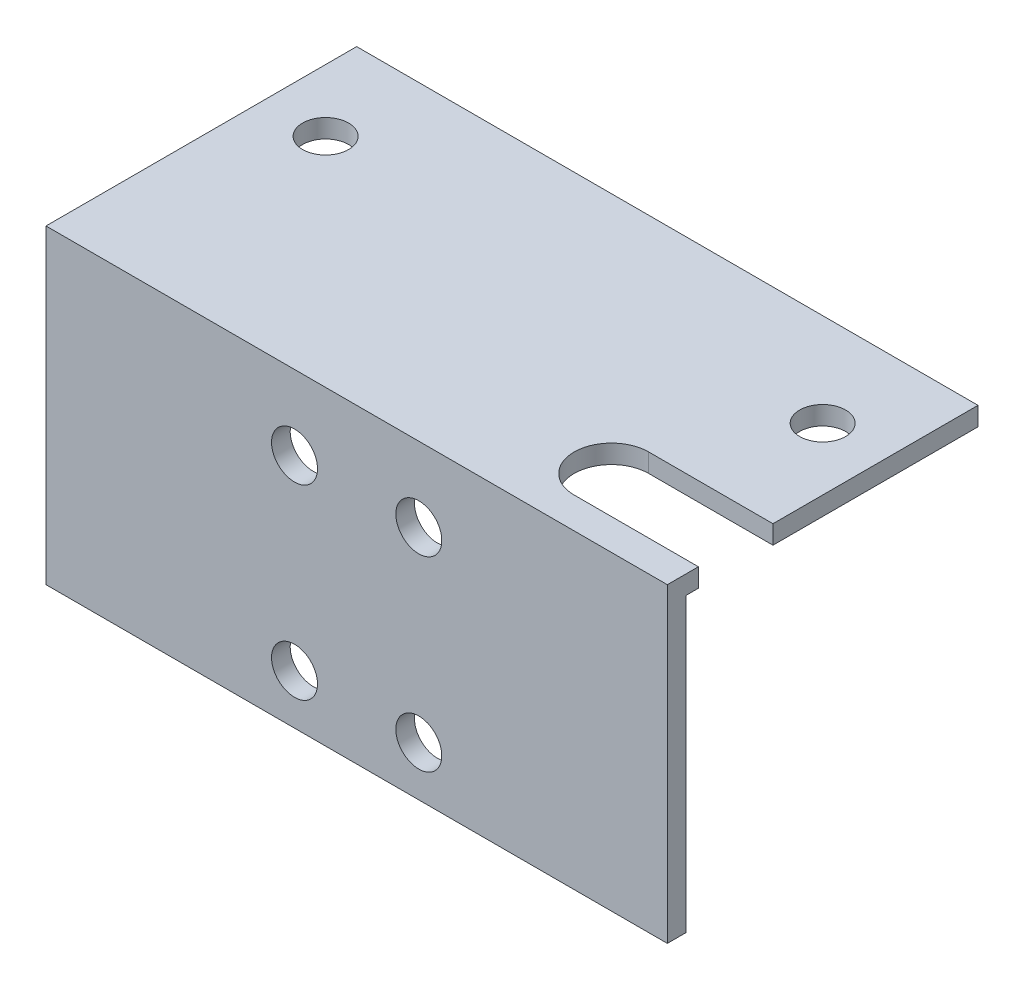
ISO-10303-21;
HEADER;
FILE_DESCRIPTION(('STEP AP214'),'2;1');
FILE_NAME('part.step','',(''),(''),'','','');
FILE_SCHEMA(('AUTOMOTIVE_DESIGN { 1 0 10303 214 1 1 1 1 }'));
ENDSEC;
DATA;
#1=APPLICATION_CONTEXT('core data for automotive mechanical design processes');
#2=APPLICATION_PROTOCOL_DEFINITION('international standard','automotive_design',2000,#1);
#3=PRODUCT_CONTEXT('',#1,'mechanical');
#4=PRODUCT('Part','Part','',(#3));
#5=PRODUCT_RELATED_PRODUCT_CATEGORY('part','',(#4));
#6=PRODUCT_DEFINITION_FORMATION('','',#4);
#7=PRODUCT_DEFINITION_CONTEXT('part definition',#1,'design');
#8=PRODUCT_DEFINITION('design','',#6,#7);
#9=PRODUCT_DEFINITION_SHAPE('','',#8);
#10=(LENGTH_UNIT() NAMED_UNIT(*) SI_UNIT(.MILLI.,.METRE.));
#11=(NAMED_UNIT(*) PLANE_ANGLE_UNIT() SI_UNIT($,.RADIAN.));
#12=(NAMED_UNIT(*) SI_UNIT($,.STERADIAN.) SOLID_ANGLE_UNIT());
#13=UNCERTAINTY_MEASURE_WITH_UNIT(LENGTH_MEASURE(1.E-05),#10,'distance_accuracy_value','');
#14=(GEOMETRIC_REPRESENTATION_CONTEXT(3) GLOBAL_UNCERTAINTY_ASSIGNED_CONTEXT((#13)) GLOBAL_UNIT_ASSIGNED_CONTEXT((#10,
#11,#12)) REPRESENTATION_CONTEXT('',''));
#15=CARTESIAN_POINT('',(0.,0.,0.));
#16=DIRECTION('',(0.,0.,1.));
#17=DIRECTION('',(1.,0.,0.));
#18=AXIS2_PLACEMENT_3D('',#15,#16,#17);
#19=CARTESIAN_POINT('',(50.,1.5,0.));
#20=DIRECTION('',(-1.,0.,0.));
#21=DIRECTION('',(0.,0.,1.));
#22=AXIS2_PLACEMENT_3D('',#19,#20,#21);
#23=PLANE('',#22);
#24=DIRECTION('',(0.,0.,-1.));
#25=VECTOR('',#24,1.);
#26=CARTESIAN_POINT('',(50.,1.5,0.));
#27=LINE('',#26,#25);
#28=CARTESIAN_POINT('',(50.,1.5,-8.5));
#29=VERTEX_POINT('',#28);
#30=CARTESIAN_POINT('',(50.,1.5,-25.));
#31=VERTEX_POINT('',#30);
#32=EDGE_CURVE('E197',#29,#31,#27,.T.);
#33=ORIENTED_EDGE('',*,*,#32,.F.);
#34=DIRECTION('',(0.,-1.,0.));
#35=VECTOR('',#34,1.);
#36=CARTESIAN_POINT('',(50.,1.5,-8.5));
#37=LINE('',#36,#35);
#38=CARTESIAN_POINT('',(50.,0.,-8.5));
#39=VERTEX_POINT('',#38);
#40=EDGE_CURVE('E11',#29,#39,#37,.T.);
#41=ORIENTED_EDGE('',*,*,#40,.T.);
#42=DIRECTION('',(0.,0.,-1.));
#43=VECTOR('',#42,1.);
#44=CARTESIAN_POINT('',(50.,0.,0.));
#45=LINE('',#44,#43);
#46=CARTESIAN_POINT('',(50.,0.,-25.));
#47=VERTEX_POINT('',#46);
#48=EDGE_CURVE('E133',#39,#47,#45,.T.);
#49=ORIENTED_EDGE('',*,*,#48,.T.);
#50=DIRECTION('',(0.,-1.,0.));
#51=VECTOR('',#50,1.);
#52=CARTESIAN_POINT('',(50.,1.5,-25.));
#53=LINE('',#52,#51);
#54=EDGE_CURVE('E144',#31,#47,#53,.T.);
#55=ORIENTED_EDGE('',*,*,#54,.F.);
#56=EDGE_LOOP('',(#33,#41,#49,#55));
#57=FACE_BOUND('',#56,.T.);
#58=ADVANCED_FACE('F34',(#57),#23,.F.);
#59=CARTESIAN_POINT('',(0.,1.5,0.));
#60=DIRECTION('',(0.,-1.,0.));
#61=DIRECTION('',(0.,0.,-1.));
#62=AXIS2_PLACEMENT_3D('',#59,#60,#61);
#63=PLANE('',#62);
#64=CARTESIAN_POINT('',(40.,1.5,-5.5));
#65=DIRECTION('',(0.,-1.,0.));
#66=DIRECTION('',(0.,0.,-1.));
#67=AXIS2_PLACEMENT_3D('',#64,#65,#66);
#68=CIRCLE('',#67,3.);
#69=CARTESIAN_POINT('',(40.,1.5,-2.5));
#70=VERTEX_POINT('',#69);
#71=CARTESIAN_POINT('',(40.,1.5,-8.5));
#72=VERTEX_POINT('',#71);
#73=EDGE_CURVE('E218',#70,#72,#68,.T.);
#74=ORIENTED_EDGE('',*,*,#73,.T.);
#75=DIRECTION('',(1.,0.,0.));
#76=VECTOR('',#75,1.);
#77=CARTESIAN_POINT('',(0.,1.5,-8.50000000000002));
#78=LINE('',#77,#76);
#79=EDGE_CURVE('E216',#72,#29,#78,.T.);
#80=ORIENTED_EDGE('',*,*,#79,.T.);
#81=ORIENTED_EDGE('',*,*,#32,.T.);
#82=DIRECTION('',(-1.,0.,0.));
#83=VECTOR('',#82,1.);
#84=CARTESIAN_POINT('',(0.,1.5,-25.));
#85=LINE('',#84,#83);
#86=CARTESIAN_POINT('',(0.,1.5,-25.));
#87=VERTEX_POINT('',#86);
#88=EDGE_CURVE('E145',#31,#87,#85,.T.);
#89=ORIENTED_EDGE('',*,*,#88,.T.);
#90=DIRECTION('',(0.,0.,1.));
#91=VECTOR('',#90,1.);
#92=CARTESIAN_POINT('',(0.,1.5,0.));
#93=LINE('',#92,#91);
#94=CARTESIAN_POINT('',(0.,1.5,0.));
#95=VERTEX_POINT('',#94);
#96=EDGE_CURVE('E135',#87,#95,#93,.T.);
#97=ORIENTED_EDGE('',*,*,#96,.T.);
#98=DIRECTION('',(1.,0.,0.));
#99=VECTOR('',#98,1.);
#100=CARTESIAN_POINT('',(0.,1.5,0.));
#101=LINE('',#100,#99);
#102=CARTESIAN_POINT('',(50.,1.5,0.));
#103=VERTEX_POINT('',#102);
#104=EDGE_CURVE('E157',#95,#103,#101,.T.);
#105=ORIENTED_EDGE('',*,*,#104,.T.);
#106=CARTESIAN_POINT('',(50.,1.5,-2.5));
#107=VERTEX_POINT('',#106);
#108=EDGE_CURVE('E198',#103,#107,#27,.T.);
#109=ORIENTED_EDGE('',*,*,#108,.T.);
#110=DIRECTION('',(-1.,0.,0.));
#111=VECTOR('',#110,1.);
#112=CARTESIAN_POINT('',(0.,1.5,-2.5));
#113=LINE('',#112,#111);
#114=EDGE_CURVE('E49',#107,#70,#113,.T.);
#115=ORIENTED_EDGE('',*,*,#114,.T.);
#116=EDGE_LOOP('',(#74,#80,#81,#89,#97,#105,#109,#115));
#117=FACE_BOUND('',#116,.T.);
#118=CARTESIAN_POINT('',(5.,1.5,-17.5));
#119=DIRECTION('',(0.,1.,0.));
#120=DIRECTION('',(0.,0.,1.));
#121=AXIS2_PLACEMENT_3D('',#118,#119,#120);
#122=CIRCLE('',#121,1.85);
#123=CARTESIAN_POINT('',(5.,1.5,-15.65));
#124=VERTEX_POINT('',#123);
#125=EDGE_CURVE('E190',#124,#124,#122,.T.);
#126=ORIENTED_EDGE('',*,*,#125,.F.);
#127=EDGE_LOOP('',(#126));
#128=FACE_BOUND('',#127,.T.);
#129=CARTESIAN_POINT('',(45.,1.5,-17.5));
#130=DIRECTION('',(0.,1.,0.));
#131=DIRECTION('',(0.,0.,1.));
#132=AXIS2_PLACEMENT_3D('',#129,#130,#131);
#133=CIRCLE('',#132,1.85);
#134=CARTESIAN_POINT('',(45.,1.5,-15.65));
#135=VERTEX_POINT('',#134);
#136=EDGE_CURVE('E184',#135,#135,#133,.T.);
#137=ORIENTED_EDGE('',*,*,#136,.F.);
#138=EDGE_LOOP('',(#137));
#139=FACE_BOUND('',#138,.T.);
#140=ADVANCED_FACE('F203',(#117,#128,#139),#63,.F.);
#141=CARTESIAN_POINT('',(0.,0.,0.));
#142=DIRECTION('',(0.,-1.,0.));
#143=DIRECTION('',(0.,0.,-1.));
#144=AXIS2_PLACEMENT_3D('',#141,#142,#143);
#145=PLANE('',#144);
#146=DIRECTION('',(1.,0.,0.));
#147=VECTOR('',#146,1.);
#148=CARTESIAN_POINT('',(50.,0.,-8.5));
#149=LINE('',#148,#147);
#150=CARTESIAN_POINT('',(40.,0.,-8.5));
#151=VERTEX_POINT('',#150);
#152=EDGE_CURVE('E212',#151,#39,#149,.T.);
#153=ORIENTED_EDGE('',*,*,#152,.F.);
#154=CARTESIAN_POINT('',(40.,0.,-5.5));
#155=DIRECTION('',(0.,-1.,0.));
#156=DIRECTION('',(0.,0.,-1.));
#157=AXIS2_PLACEMENT_3D('',#154,#155,#156);
#158=CIRCLE('',#157,3.);
#159=CARTESIAN_POINT('',(40.,0.,-2.5));
#160=VERTEX_POINT('',#159);
#161=EDGE_CURVE('E125',#160,#151,#158,.T.);
#162=ORIENTED_EDGE('',*,*,#161,.F.);
#163=DIRECTION('',(-1.,0.,0.));
#164=VECTOR('',#163,1.);
#165=CARTESIAN_POINT('',(50.,0.,-2.5));
#166=LINE('',#165,#164);
#167=CARTESIAN_POINT('',(50.,0.,-2.5));
#168=VERTEX_POINT('',#167);
#169=EDGE_CURVE('E113',#168,#160,#166,.T.);
#170=ORIENTED_EDGE('',*,*,#169,.F.);
#171=CARTESIAN_POINT('',(50.,0.,-1.5));
#172=VERTEX_POINT('',#171);
#173=EDGE_CURVE('E123',#172,#168,#45,.T.);
#174=ORIENTED_EDGE('',*,*,#173,.F.);
#175=DIRECTION('',(1.,0.,0.));
#176=VECTOR('',#175,1.);
#177=CARTESIAN_POINT('',(0.,0.,-1.5));
#178=LINE('',#177,#176);
#179=CARTESIAN_POINT('',(0.,0.,-1.5));
#180=VERTEX_POINT('',#179);
#181=EDGE_CURVE('E57',#180,#172,#178,.T.);
#182=ORIENTED_EDGE('',*,*,#181,.F.);
#183=DIRECTION('',(0.,0.,1.));
#184=VECTOR('',#183,1.);
#185=CARTESIAN_POINT('',(0.,0.,0.));
#186=LINE('',#185,#184);
#187=CARTESIAN_POINT('',(0.,0.,-25.));
#188=VERTEX_POINT('',#187);
#189=EDGE_CURVE('E137',#188,#180,#186,.T.);
#190=ORIENTED_EDGE('',*,*,#189,.F.);
#191=DIRECTION('',(-1.,0.,0.));
#192=VECTOR('',#191,1.);
#193=CARTESIAN_POINT('',(0.,0.,-25.));
#194=LINE('',#193,#192);
#195=EDGE_CURVE('E132',#47,#188,#194,.T.);
#196=ORIENTED_EDGE('',*,*,#195,.F.);
#197=ORIENTED_EDGE('',*,*,#48,.F.);
#198=EDGE_LOOP('',(#153,#162,#170,#174,#182,#190,#196,#197));
#199=FACE_BOUND('',#198,.T.);
#200=CARTESIAN_POINT('',(5.,0.,-17.5));
#201=DIRECTION('',(0.,1.,0.));
#202=DIRECTION('',(0.,0.,1.));
#203=AXIS2_PLACEMENT_3D('',#200,#201,#202);
#204=CIRCLE('',#203,1.85);
#205=CARTESIAN_POINT('',(5.,0.,-15.65));
#206=VERTEX_POINT('',#205);
#207=EDGE_CURVE('E187',#206,#206,#204,.T.);
#208=ORIENTED_EDGE('',*,*,#207,.T.);
#209=EDGE_LOOP('',(#208));
#210=FACE_BOUND('',#209,.T.);
#211=CARTESIAN_POINT('',(45.,0.,-17.5));
#212=DIRECTION('',(0.,1.,0.));
#213=DIRECTION('',(0.,0.,1.));
#214=AXIS2_PLACEMENT_3D('',#211,#212,#213);
#215=CIRCLE('',#214,1.85);
#216=CARTESIAN_POINT('',(45.,0.,-15.65));
#217=VERTEX_POINT('',#216);
#218=EDGE_CURVE('E183',#217,#217,#215,.T.);
#219=ORIENTED_EDGE('',*,*,#218,.T.);
#220=EDGE_LOOP('',(#219));
#221=FACE_BOUND('',#220,.T.);
#222=ADVANCED_FACE('F121',(#199,#210,#221),#145,.T.);
#223=CARTESIAN_POINT('',(0.,1.5,0.));
#224=DIRECTION('',(1.,0.,0.));
#225=DIRECTION('',(0.,0.,-1.));
#226=AXIS2_PLACEMENT_3D('',#223,#224,#225);
#227=PLANE('',#226);
#228=ORIENTED_EDGE('',*,*,#189,.T.);
#229=DIRECTION('',(0.,1.,0.));
#230=VECTOR('',#229,1.);
#231=CARTESIAN_POINT('',(0.,-23.5,-1.5));
#232=LINE('',#231,#230);
#233=CARTESIAN_POINT('',(0.,-23.5,-1.5));
#234=VERTEX_POINT('',#233);
#235=EDGE_CURVE('E171',#234,#180,#232,.T.);
#236=ORIENTED_EDGE('',*,*,#235,.F.);
#237=DIRECTION('',(0.,0.,-1.));
#238=VECTOR('',#237,1.);
#239=CARTESIAN_POINT('',(0.,-23.5,0.));
#240=LINE('',#239,#238);
#241=CARTESIAN_POINT('',(0.,-23.5,0.));
#242=VERTEX_POINT('',#241);
#243=EDGE_CURVE('E166',#242,#234,#240,.T.);
#244=ORIENTED_EDGE('',*,*,#243,.F.);
#245=DIRECTION('',(0.,-1.,0.));
#246=VECTOR('',#245,1.);
#247=CARTESIAN_POINT('',(0.,1.5,0.));
#248=LINE('',#247,#246);
#249=EDGE_CURVE('E119',#95,#242,#248,.T.);
#250=ORIENTED_EDGE('',*,*,#249,.F.);
#251=ORIENTED_EDGE('',*,*,#96,.F.);
#252=DIRECTION('',(0.,-1.,0.));
#253=VECTOR('',#252,1.);
#254=CARTESIAN_POINT('',(0.,1.5,-25.));
#255=LINE('',#254,#253);
#256=EDGE_CURVE('E141',#87,#188,#255,.T.);
#257=ORIENTED_EDGE('',*,*,#256,.T.);
#258=EDGE_LOOP('',(#228,#236,#244,#250,#251,#257));
#259=FACE_BOUND('',#258,.T.);
#260=ADVANCED_FACE('F36',(#259),#227,.F.);
#261=CARTESIAN_POINT('',(0.,1.5,0.));
#262=DIRECTION('',(0.,0.,-1.));
#263=DIRECTION('',(-1.,0.,0.));
#264=AXIS2_PLACEMENT_3D('',#261,#262,#263);
#265=PLANE('',#264);
#266=CARTESIAN_POINT('',(30.,-19.5,0.));
#267=DIRECTION('',(0.,0.,-1.));
#268=DIRECTION('',(-1.,0.,0.));
#269=AXIS2_PLACEMENT_3D('',#266,#267,#268);
#270=CIRCLE('',#269,1.85);
#271=CARTESIAN_POINT('',(28.15,-19.5,0.));
#272=VERTEX_POINT('',#271);
#273=EDGE_CURVE('E175',#272,#272,#270,.T.);
#274=ORIENTED_EDGE('',*,*,#273,.T.);
#275=EDGE_LOOP('',(#274));
#276=FACE_BOUND('',#275,.T.);
#277=CARTESIAN_POINT('',(20.,-4.49999999999999,0.));
#278=DIRECTION('',(0.,0.,-1.));
#279=DIRECTION('',(-1.,0.,0.));
#280=AXIS2_PLACEMENT_3D('',#277,#278,#279);
#281=CIRCLE('',#280,1.85);
#282=CARTESIAN_POINT('',(18.15,-4.49999999999999,0.));
#283=VERTEX_POINT('',#282);
#284=EDGE_CURVE('E242',#283,#283,#281,.T.);
#285=ORIENTED_EDGE('',*,*,#284,.T.);
#286=EDGE_LOOP('',(#285));
#287=FACE_BOUND('',#286,.T.);
#288=CARTESIAN_POINT('',(30.,-4.49999999999999,0.));
#289=DIRECTION('',(0.,0.,-1.));
#290=DIRECTION('',(-1.,0.,0.));
#291=AXIS2_PLACEMENT_3D('',#288,#289,#290);
#292=CIRCLE('',#291,1.85);
#293=CARTESIAN_POINT('',(28.15,-4.49999999999999,0.));
#294=VERTEX_POINT('',#293);
#295=EDGE_CURVE('E240',#294,#294,#292,.T.);
#296=ORIENTED_EDGE('',*,*,#295,.T.);
#297=EDGE_LOOP('',(#296));
#298=FACE_BOUND('',#297,.T.);
#299=CARTESIAN_POINT('',(20.,-19.5,0.));
#300=DIRECTION('',(0.,0.,-1.));
#301=DIRECTION('',(-1.,0.,0.));
#302=AXIS2_PLACEMENT_3D('',#299,#300,#301);
#303=CIRCLE('',#302,1.85);
#304=CARTESIAN_POINT('',(18.15,-19.5,0.));
#305=VERTEX_POINT('',#304);
#306=EDGE_CURVE('E237',#305,#305,#303,.T.);
#307=ORIENTED_EDGE('',*,*,#306,.T.);
#308=EDGE_LOOP('',(#307));
#309=FACE_BOUND('',#308,.T.);
#310=ORIENTED_EDGE('',*,*,#249,.T.);
#311=DIRECTION('',(-1.,0.,0.));
#312=VECTOR('',#311,1.);
#313=CARTESIAN_POINT('',(0.,-23.5,0.));
#314=LINE('',#313,#312);
#315=CARTESIAN_POINT('',(50.,-23.5,0.));
#316=VERTEX_POINT('',#315);
#317=EDGE_CURVE('E156',#316,#242,#314,.T.);
#318=ORIENTED_EDGE('',*,*,#317,.F.);
#319=DIRECTION('',(0.,-1.,0.));
#320=VECTOR('',#319,1.);
#321=CARTESIAN_POINT('',(50.,1.5,0.));
#322=LINE('',#321,#320);
#323=EDGE_CURVE('E148',#103,#316,#322,.T.);
#324=ORIENTED_EDGE('',*,*,#323,.F.);
#325=ORIENTED_EDGE('',*,*,#104,.F.);
#326=EDGE_LOOP('',(#310,#318,#324,#325));
#327=FACE_BOUND('',#326,.T.);
#328=ADVANCED_FACE('F154',(#276,#287,#298,#309,#327),#265,.F.);
#329=ORIENTED_EDGE('',*,*,#173,.T.);
#330=DIRECTION('',(0.,1.,0.));
#331=VECTOR('',#330,1.);
#332=CARTESIAN_POINT('',(50.,1.5,-2.5));
#333=LINE('',#332,#331);
#334=EDGE_CURVE('E42',#168,#107,#333,.T.);
#335=ORIENTED_EDGE('',*,*,#334,.T.);
#336=ORIENTED_EDGE('',*,*,#108,.F.);
#337=ORIENTED_EDGE('',*,*,#323,.T.);
#338=DIRECTION('',(0.,0.,1.));
#339=VECTOR('',#338,1.);
#340=CARTESIAN_POINT('',(50.,-23.5,0.));
#341=LINE('',#340,#339);
#342=CARTESIAN_POINT('',(50.,-23.5,-1.5));
#343=VERTEX_POINT('',#342);
#344=EDGE_CURVE('E168',#343,#316,#341,.T.);
#345=ORIENTED_EDGE('',*,*,#344,.F.);
#346=DIRECTION('',(0.,1.,0.));
#347=VECTOR('',#346,1.);
#348=CARTESIAN_POINT('',(50.,-23.5,-1.5));
#349=LINE('',#348,#347);
#350=EDGE_CURVE('E131',#343,#172,#349,.T.);
#351=ORIENTED_EDGE('',*,*,#350,.T.);
#352=EDGE_LOOP('',(#329,#335,#336,#337,#345,#351));
#353=FACE_BOUND('',#352,.T.);
#354=ADVANCED_FACE('F128',(#353),#23,.F.);
#355=CARTESIAN_POINT('',(0.,1.5,-25.));
#356=DIRECTION('',(0.,0.,1.));
#357=DIRECTION('',(1.,0.,0.));
#358=AXIS2_PLACEMENT_3D('',#355,#356,#357);
#359=PLANE('',#358);
#360=ORIENTED_EDGE('',*,*,#195,.T.);
#361=ORIENTED_EDGE('',*,*,#256,.F.);
#362=ORIENTED_EDGE('',*,*,#88,.F.);
#363=ORIENTED_EDGE('',*,*,#54,.T.);
#364=EDGE_LOOP('',(#360,#361,#362,#363));
#365=FACE_BOUND('',#364,.T.);
#366=ADVANCED_FACE('F209',(#365),#359,.F.);
#367=CARTESIAN_POINT('',(5.,1.5,-17.5));
#368=DIRECTION('',(0.,-1.,0.));
#369=DIRECTION('',(0.,0.,-1.));
#370=AXIS2_PLACEMENT_3D('',#367,#368,#369);
#371=CYLINDRICAL_SURFACE('',#370,1.85);
#372=ORIENTED_EDGE('',*,*,#125,.T.);
#373=EDGE_LOOP('',(#372));
#374=FACE_BOUND('',#373,.T.);
#375=ORIENTED_EDGE('',*,*,#207,.F.);
#376=EDGE_LOOP('',(#375));
#377=FACE_BOUND('',#376,.T.);
#378=ADVANCED_FACE('F278',(#374,#377),#371,.F.);
#379=CARTESIAN_POINT('',(45.,1.5,-17.5));
#380=DIRECTION('',(0.,-1.,0.));
#381=DIRECTION('',(0.,0.,-1.));
#382=AXIS2_PLACEMENT_3D('',#379,#380,#381);
#383=CYLINDRICAL_SURFACE('',#382,1.85);
#384=ORIENTED_EDGE('',*,*,#136,.T.);
#385=EDGE_LOOP('',(#384));
#386=FACE_BOUND('',#385,.T.);
#387=ORIENTED_EDGE('',*,*,#218,.F.);
#388=EDGE_LOOP('',(#387));
#389=FACE_BOUND('',#388,.T.);
#390=ADVANCED_FACE('F291',(#386,#389),#383,.F.);
#391=CARTESIAN_POINT('',(0.,-23.5,-1.5));
#392=DIRECTION('',(0.,0.,1.));
#393=DIRECTION('',(1.,0.,0.));
#394=AXIS2_PLACEMENT_3D('',#391,#392,#393);
#395=PLANE('',#394);
#396=CARTESIAN_POINT('',(30.,-19.5,-1.5));
#397=DIRECTION('',(0.,0.,-1.));
#398=DIRECTION('',(-1.,0.,0.));
#399=AXIS2_PLACEMENT_3D('',#396,#397,#398);
#400=CIRCLE('',#399,1.85);
#401=CARTESIAN_POINT('',(28.15,-19.5,-1.5));
#402=VERTEX_POINT('',#401);
#403=EDGE_CURVE('E229',#402,#402,#400,.T.);
#404=ORIENTED_EDGE('',*,*,#403,.F.);
#405=EDGE_LOOP('',(#404));
#406=FACE_BOUND('',#405,.T.);
#407=CARTESIAN_POINT('',(20.,-4.49999999999999,-1.5));
#408=DIRECTION('',(0.,0.,-1.));
#409=DIRECTION('',(-1.,0.,0.));
#410=AXIS2_PLACEMENT_3D('',#407,#408,#409);
#411=CIRCLE('',#410,1.85);
#412=CARTESIAN_POINT('',(18.15,-4.49999999999999,-1.5));
#413=VERTEX_POINT('',#412);
#414=EDGE_CURVE('E228',#413,#413,#411,.T.);
#415=ORIENTED_EDGE('',*,*,#414,.F.);
#416=EDGE_LOOP('',(#415));
#417=FACE_BOUND('',#416,.T.);
#418=CARTESIAN_POINT('',(30.,-4.49999999999999,-1.5));
#419=DIRECTION('',(0.,0.,-1.));
#420=DIRECTION('',(-1.,0.,0.));
#421=AXIS2_PLACEMENT_3D('',#418,#419,#420);
#422=CIRCLE('',#421,1.85);
#423=CARTESIAN_POINT('',(28.15,-4.49999999999999,-1.5));
#424=VERTEX_POINT('',#423);
#425=EDGE_CURVE('E220',#424,#424,#422,.T.);
#426=ORIENTED_EDGE('',*,*,#425,.F.);
#427=EDGE_LOOP('',(#426));
#428=FACE_BOUND('',#427,.T.);
#429=CARTESIAN_POINT('',(20.,-19.5,-1.5));
#430=DIRECTION('',(0.,0.,-1.));
#431=DIRECTION('',(-1.,0.,0.));
#432=AXIS2_PLACEMENT_3D('',#429,#430,#431);
#433=CIRCLE('',#432,1.85);
#434=CARTESIAN_POINT('',(18.15,-19.5,-1.5));
#435=VERTEX_POINT('',#434);
#436=EDGE_CURVE('E232',#435,#435,#433,.T.);
#437=ORIENTED_EDGE('',*,*,#436,.F.);
#438=EDGE_LOOP('',(#437));
#439=FACE_BOUND('',#438,.T.);
#440=ORIENTED_EDGE('',*,*,#181,.T.);
#441=ORIENTED_EDGE('',*,*,#350,.F.);
#442=DIRECTION('',(1.,0.,0.));
#443=VECTOR('',#442,1.);
#444=CARTESIAN_POINT('',(0.,-23.5,-1.5));
#445=LINE('',#444,#443);
#446=EDGE_CURVE('E172',#234,#343,#445,.T.);
#447=ORIENTED_EDGE('',*,*,#446,.F.);
#448=ORIENTED_EDGE('',*,*,#235,.T.);
#449=EDGE_LOOP('',(#440,#441,#447,#448));
#450=FACE_BOUND('',#449,.T.);
#451=ADVANCED_FACE('F295',(#406,#417,#428,#439,#450),#395,.F.);
#452=CARTESIAN_POINT('',(0.,-23.5,0.));
#453=DIRECTION('',(0.,-1.,0.));
#454=DIRECTION('',(0.,0.,-1.));
#455=AXIS2_PLACEMENT_3D('',#452,#453,#454);
#456=PLANE('',#455);
#457=ORIENTED_EDGE('',*,*,#243,.T.);
#458=ORIENTED_EDGE('',*,*,#446,.T.);
#459=ORIENTED_EDGE('',*,*,#344,.T.);
#460=ORIENTED_EDGE('',*,*,#317,.T.);
#461=EDGE_LOOP('',(#457,#458,#459,#460));
#462=FACE_BOUND('',#461,.T.);
#463=ADVANCED_FACE('F165',(#462),#456,.T.);
#464=CARTESIAN_POINT('',(20.,-19.5,22.));
#465=DIRECTION('',(0.,0.,-1.));
#466=DIRECTION('',(-1.,0.,0.));
#467=AXIS2_PLACEMENT_3D('',#464,#465,#466);
#468=CYLINDRICAL_SURFACE('',#467,1.85);
#469=ORIENTED_EDGE('',*,*,#436,.T.);
#470=EDGE_LOOP('',(#469));
#471=FACE_BOUND('',#470,.T.);
#472=ORIENTED_EDGE('',*,*,#306,.F.);
#473=EDGE_LOOP('',(#472));
#474=FACE_BOUND('',#473,.T.);
#475=ADVANCED_FACE('F302',(#471,#474),#468,.F.);
#476=CARTESIAN_POINT('',(30.,-4.49999999999999,22.));
#477=DIRECTION('',(0.,0.,-1.));
#478=DIRECTION('',(-1.,0.,0.));
#479=AXIS2_PLACEMENT_3D('',#476,#477,#478);
#480=CYLINDRICAL_SURFACE('',#479,1.85);
#481=ORIENTED_EDGE('',*,*,#425,.T.);
#482=EDGE_LOOP('',(#481));
#483=FACE_BOUND('',#482,.T.);
#484=ORIENTED_EDGE('',*,*,#295,.F.);
#485=EDGE_LOOP('',(#484));
#486=FACE_BOUND('',#485,.T.);
#487=ADVANCED_FACE('F262',(#483,#486),#480,.F.);
#488=CARTESIAN_POINT('',(20.,-4.49999999999999,22.));
#489=DIRECTION('',(0.,0.,-1.));
#490=DIRECTION('',(-1.,0.,0.));
#491=AXIS2_PLACEMENT_3D('',#488,#489,#490);
#492=CYLINDRICAL_SURFACE('',#491,1.85);
#493=ORIENTED_EDGE('',*,*,#414,.T.);
#494=EDGE_LOOP('',(#493));
#495=FACE_BOUND('',#494,.T.);
#496=ORIENTED_EDGE('',*,*,#284,.F.);
#497=EDGE_LOOP('',(#496));
#498=FACE_BOUND('',#497,.T.);
#499=ADVANCED_FACE('F253',(#495,#498),#492,.F.);
#500=CARTESIAN_POINT('',(30.,-19.5,22.));
#501=DIRECTION('',(0.,0.,-1.));
#502=DIRECTION('',(-1.,0.,0.));
#503=AXIS2_PLACEMENT_3D('',#500,#501,#502);
#504=CYLINDRICAL_SURFACE('',#503,1.85);
#505=ORIENTED_EDGE('',*,*,#403,.T.);
#506=EDGE_LOOP('',(#505));
#507=FACE_BOUND('',#506,.T.);
#508=ORIENTED_EDGE('',*,*,#273,.F.);
#509=EDGE_LOOP('',(#508));
#510=FACE_BOUND('',#509,.T.);
#511=ADVANCED_FACE('F250',(#507,#510),#504,.F.);
#512=CARTESIAN_POINT('',(40.,10.,-5.5));
#513=DIRECTION('',(0.,-1.,0.));
#514=DIRECTION('',(0.,0.,-1.));
#515=AXIS2_PLACEMENT_3D('',#512,#513,#514);
#516=CYLINDRICAL_SURFACE('',#515,3.);
#517=DIRECTION('',(0.,-1.,0.));
#518=VECTOR('',#517,1.);
#519=CARTESIAN_POINT('',(40.,10.,-2.5));
#520=LINE('',#519,#518);
#521=EDGE_CURVE('E442',#70,#160,#520,.T.);
#522=ORIENTED_EDGE('',*,*,#521,.T.);
#523=ORIENTED_EDGE('',*,*,#161,.T.);
#524=DIRECTION('',(0.,-1.,0.));
#525=VECTOR('',#524,1.);
#526=CARTESIAN_POINT('',(40.,10.,-8.5));
#527=LINE('',#526,#525);
#528=EDGE_CURVE('E222',#72,#151,#527,.T.);
#529=ORIENTED_EDGE('',*,*,#528,.F.);
#530=ORIENTED_EDGE('',*,*,#73,.F.);
#531=EDGE_LOOP('',(#522,#523,#529,#530));
#532=FACE_BOUND('',#531,.T.);
#533=ADVANCED_FACE('F252',(#532),#516,.F.);
#534=CARTESIAN_POINT('',(50.,10.,-8.5));
#535=DIRECTION('',(0.,0.,-1.));
#536=DIRECTION('',(-1.,0.,0.));
#537=AXIS2_PLACEMENT_3D('',#534,#535,#536);
#538=PLANE('',#537);
#539=ORIENTED_EDGE('',*,*,#528,.T.);
#540=ORIENTED_EDGE('',*,*,#152,.T.);
#541=ORIENTED_EDGE('',*,*,#40,.F.);
#542=ORIENTED_EDGE('',*,*,#79,.F.);
#543=EDGE_LOOP('',(#539,#540,#541,#542));
#544=FACE_BOUND('',#543,.T.);
#545=ADVANCED_FACE('F215',(#544),#538,.F.);
#546=CARTESIAN_POINT('',(50.,10.,-2.5));
#547=DIRECTION('',(0.,0.,1.));
#548=DIRECTION('',(1.,0.,0.));
#549=AXIS2_PLACEMENT_3D('',#546,#547,#548);
#550=PLANE('',#549);
#551=ORIENTED_EDGE('',*,*,#334,.F.);
#552=ORIENTED_EDGE('',*,*,#169,.T.);
#553=ORIENTED_EDGE('',*,*,#521,.F.);
#554=ORIENTED_EDGE('',*,*,#114,.F.);
#555=EDGE_LOOP('',(#551,#552,#553,#554));
#556=FACE_BOUND('',#555,.T.);
#557=ADVANCED_FACE('F112',(#556),#550,.F.);
#558=CLOSED_SHELL('',(#58,#140,#222,#260,#328,#354,#366,#378,#390,#451,#463,#475,#487,#499,#511,
#533,#545,#557));
#559=MANIFOLD_SOLID_BREP('B2',#558);
#560=ADVANCED_BREP_SHAPE_REPRESENTATION('',(#18,#559),#14);
#561=SHAPE_DEFINITION_REPRESENTATION(#9,#560);
ENDSEC;
END-ISO-10303-21;
